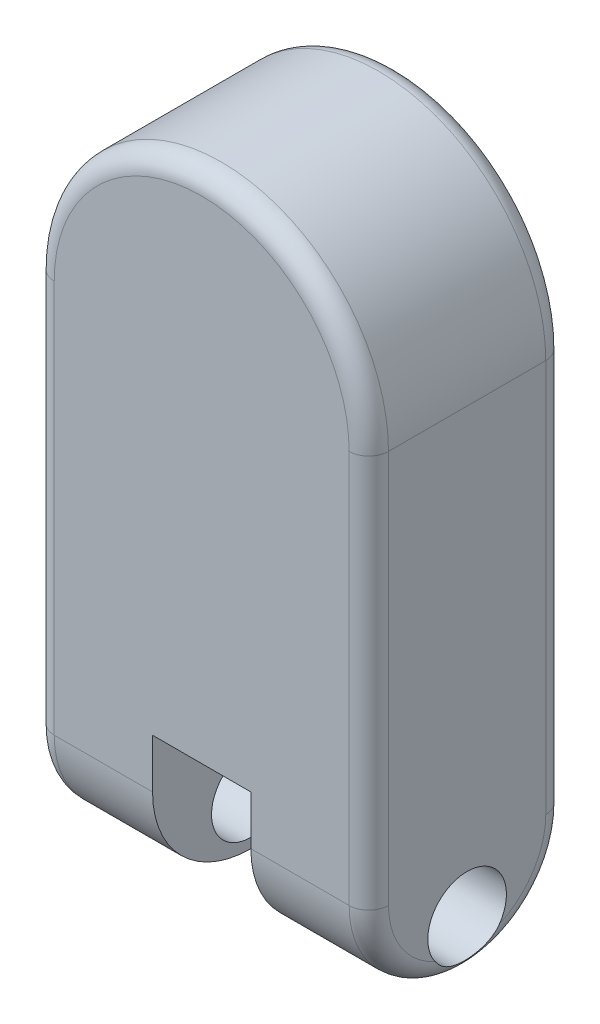
ISO-10303-21;
HEADER;
FILE_DESCRIPTION(('STEP AP214'),'2;1');
FILE_NAME('part.step','',(''),(''),'','','');
FILE_SCHEMA(('AUTOMOTIVE_DESIGN { 1 0 10303 214 1 1 1 1 }'));
ENDSEC;
DATA;
#1=APPLICATION_CONTEXT('core data for automotive mechanical design processes');
#2=APPLICATION_PROTOCOL_DEFINITION('international standard','automotive_design',2000,#1);
#3=PRODUCT_CONTEXT('',#1,'mechanical');
#4=PRODUCT('Part','Part','',(#3));
#5=PRODUCT_RELATED_PRODUCT_CATEGORY('part','',(#4));
#6=PRODUCT_DEFINITION_FORMATION('','',#4);
#7=PRODUCT_DEFINITION_CONTEXT('part definition',#1,'design');
#8=PRODUCT_DEFINITION('design','',#6,#7);
#9=PRODUCT_DEFINITION_SHAPE('','',#8);
#10=(LENGTH_UNIT() NAMED_UNIT(*) SI_UNIT(.MILLI.,.METRE.));
#11=(NAMED_UNIT(*) PLANE_ANGLE_UNIT() SI_UNIT($,.RADIAN.));
#12=(NAMED_UNIT(*) SI_UNIT($,.STERADIAN.) SOLID_ANGLE_UNIT());
#13=UNCERTAINTY_MEASURE_WITH_UNIT(LENGTH_MEASURE(1.E-05),#10,'distance_accuracy_value','');
#14=(GEOMETRIC_REPRESENTATION_CONTEXT(3) GLOBAL_UNCERTAINTY_ASSIGNED_CONTEXT((#13)) GLOBAL_UNIT_ASSIGNED_CONTEXT((#10,
#11,#12)) REPRESENTATION_CONTEXT('',''));
#15=CARTESIAN_POINT('',(0.,0.,0.));
#16=DIRECTION('',(0.,0.,1.));
#17=DIRECTION('',(1.,0.,0.));
#18=AXIS2_PLACEMENT_3D('',#15,#16,#17);
#19=CARTESIAN_POINT('',(-25.,-75.,-100.1));
#20=DIRECTION('',(0.,-1.,0.));
#21=DIRECTION('',(0.,0.,-1.));
#22=AXIS2_PLACEMENT_3D('',#19,#20,#21);
#23=PLANE('',#22);
#24=DIRECTION('',(1.,0.,0.));
#25=VECTOR('',#24,1.);
#26=CARTESIAN_POINT('',(-25.,-75.,-100.));
#27=LINE('',#26,#25);
#28=CARTESIAN_POINT('',(-25.,-75.,-100.));
#29=VERTEX_POINT('',#28);
#30=CARTESIAN_POINT('',(25.,-75.,-100.));
#31=VERTEX_POINT('',#30);
#32=EDGE_CURVE('E92',#29,#31,#27,.T.);
#33=ORIENTED_EDGE('',*,*,#32,.T.);
#34=CARTESIAN_POINT('',(23.5893264020334,-75.,-90.1));
#35=DIRECTION('',(0.,-1.,0.));
#36=DIRECTION('',(0.,0.,-1.));
#37=AXIS2_PLACEMENT_3D('',#34,#35,#36);
#38=CIRCLE('',#37,10.);
#39=CARTESIAN_POINT('',(23.5893264020334,-75.,-100.1));
#40=VERTEX_POINT('',#39);
#41=EDGE_CURVE('E12',#31,#40,#38,.F.);
#42=ORIENTED_EDGE('',*,*,#41,.T.);
#43=DIRECTION('',(1.,0.,0.));
#44=VECTOR('',#43,1.);
#45=CARTESIAN_POINT('',(-25.,-75.,-100.1));
#46=LINE('',#45,#44);
#47=CARTESIAN_POINT('',(-23.5893264020334,-75.,-100.1));
#48=VERTEX_POINT('',#47);
#49=EDGE_CURVE('E116',#48,#40,#46,.T.);
#50=ORIENTED_EDGE('',*,*,#49,.F.);
#51=CARTESIAN_POINT('',(-23.5893264020334,-75.,-90.1));
#52=DIRECTION('',(0.,-1.,0.));
#53=DIRECTION('',(0.,0.,-1.));
#54=AXIS2_PLACEMENT_3D('',#51,#52,#53);
#55=CIRCLE('',#54,10.);
#56=EDGE_CURVE('E55',#48,#29,#55,.F.);
#57=ORIENTED_EDGE('',*,*,#56,.T.);
#58=EDGE_LOOP('',(#33,#42,#50,#57));
#59=FACE_BOUND('',#58,.T.);
#60=ADVANCED_FACE('F46',(#59),#23,.F.);
#61=CARTESIAN_POINT('',(0.,0.,-100.1));
#62=DIRECTION('',(0.,0.,-1.));
#63=DIRECTION('',(-1.,0.,0.));
#64=AXIS2_PLACEMENT_3D('',#61,#62,#63);
#65=PLANE('',#64);
#66=ORIENTED_EDGE('',*,*,#49,.T.);
#67=DIRECTION('',(0.,1.,0.));
#68=VECTOR('',#67,1.);
#69=CARTESIAN_POINT('',(23.5893264020334,-105.,-100.1));
#70=LINE('',#69,#68);
#71=CARTESIAN_POINT('',(23.5893264020334,-103.589326402033,-100.1));
#72=VERTEX_POINT('',#71);
#73=EDGE_CURVE('E104',#40,#72,#70,.F.);
#74=ORIENTED_EDGE('',*,*,#73,.T.);
#75=DIRECTION('',(1.,0.,0.));
#76=VECTOR('',#75,1.);
#77=CARTESIAN_POINT('',(-25.,-103.589326402033,-100.1));
#78=LINE('',#77,#76);
#79=CARTESIAN_POINT('',(-23.5893264020334,-103.589326402033,-100.1));
#80=VERTEX_POINT('',#79);
#81=EDGE_CURVE('E70',#72,#80,#78,.F.);
#82=ORIENTED_EDGE('',*,*,#81,.T.);
#83=DIRECTION('',(0.,-1.,0.));
#84=VECTOR('',#83,1.);
#85=CARTESIAN_POINT('',(-23.5893264020334,-75.,-100.1));
#86=LINE('',#85,#84);
#87=EDGE_CURVE('E107',#80,#48,#86,.F.);
#88=ORIENTED_EDGE('',*,*,#87,.T.);
#89=EDGE_LOOP('',(#66,#74,#82,#88));
#90=FACE_BOUND('',#89,.T.);
#91=ADVANCED_FACE('F120',(#90),#65,.T.);
#92=CARTESIAN_POINT('',(0.,0.,-100.));
#93=DIRECTION('',(0.,0.,-1.));
#94=DIRECTION('',(-1.,0.,0.));
#95=AXIS2_PLACEMENT_3D('',#92,#93,#94);
#96=PLANE('',#95);
#97=ORIENTED_EDGE('',*,*,#32,.F.);
#98=DIRECTION('',(0.,1.,0.));
#99=VECTOR('',#98,1.);
#100=CARTESIAN_POINT('',(-25.,-105.,-100.));
#101=LINE('',#100,#99);
#102=CARTESIAN_POINT('',(-25.,-105.,-100.));
#103=VERTEX_POINT('',#102);
#104=EDGE_CURVE('E115',#103,#29,#101,.T.);
#105=ORIENTED_EDGE('',*,*,#104,.F.);
#106=DIRECTION('',(-1.,0.,0.));
#107=VECTOR('',#106,1.);
#108=CARTESIAN_POINT('',(25.,-105.,-100.));
#109=LINE('',#108,#107);
#110=CARTESIAN_POINT('',(25.,-105.,-100.));
#111=VERTEX_POINT('',#110);
#112=EDGE_CURVE('E95',#111,#103,#109,.T.);
#113=ORIENTED_EDGE('',*,*,#112,.F.);
#114=DIRECTION('',(0.,-1.,0.));
#115=VECTOR('',#114,1.);
#116=CARTESIAN_POINT('',(25.,-75.,-100.));
#117=LINE('',#116,#115);
#118=EDGE_CURVE('E89',#31,#111,#117,.T.);
#119=ORIENTED_EDGE('',*,*,#118,.F.);
#120=EDGE_LOOP('',(#97,#105,#113,#119));
#121=FACE_BOUND('',#120,.T.);
#122=ADVANCED_FACE('F91',(#121),#96,.F.);
#123=CARTESIAN_POINT('',(-23.5893264020334,-105.,-90.1));
#124=DIRECTION('',(0.,1.,0.));
#125=DIRECTION('',(0.,0.,1.));
#126=AXIS2_PLACEMENT_3D('',#123,#124,#125);
#127=CYLINDRICAL_SURFACE('',#126,10.);
#128=ORIENTED_EDGE('',*,*,#56,.F.);
#129=ORIENTED_EDGE('',*,*,#87,.F.);
#130=CARTESIAN_POINT('',(-23.5893264020334,-103.589326402033,-90.1));
#131=DIRECTION('',(-0.707106781186547,0.707106781186547,0.));
#132=DIRECTION('',(0.707106781186547,0.707106781186547,0.));
#133=AXIS2_PLACEMENT_3D('',#130,#131,#132);
#134=ELLIPSE('',#133,14.1421356237309,10.);
#135=EDGE_CURVE('E50',#103,#80,#134,.F.);
#136=ORIENTED_EDGE('',*,*,#135,.F.);
#137=ORIENTED_EDGE('',*,*,#104,.T.);
#138=EDGE_LOOP('',(#128,#129,#136,#137));
#139=FACE_BOUND('',#138,.T.);
#140=ADVANCED_FACE('F48',(#139),#127,.T.);
#141=CARTESIAN_POINT('',(25.,-103.589326402033,-90.1));
#142=DIRECTION('',(-1.,0.,0.));
#143=DIRECTION('',(0.,0.,1.));
#144=AXIS2_PLACEMENT_3D('',#141,#142,#143);
#145=CYLINDRICAL_SURFACE('',#144,10.);
#146=ORIENTED_EDGE('',*,*,#135,.T.);
#147=ORIENTED_EDGE('',*,*,#81,.F.);
#148=CARTESIAN_POINT('',(23.5893264020334,-103.589326402033,-90.1));
#149=DIRECTION('',(-0.707106781186547,-0.707106781186548,0.));
#150=DIRECTION('',(-0.707106781186548,0.707106781186547,0.));
#151=AXIS2_PLACEMENT_3D('',#148,#149,#150);
#152=ELLIPSE('',#151,14.142135623731,10.);
#153=EDGE_CURVE('E63',#111,#72,#152,.F.);
#154=ORIENTED_EDGE('',*,*,#153,.F.);
#155=ORIENTED_EDGE('',*,*,#112,.T.);
#156=EDGE_LOOP('',(#146,#147,#154,#155));
#157=FACE_BOUND('',#156,.T.);
#158=ADVANCED_FACE('F113',(#157),#145,.T.);
#159=CARTESIAN_POINT('',(23.5893264020334,-75.,-90.1));
#160=DIRECTION('',(0.,-1.,0.));
#161=DIRECTION('',(1.,0.,0.));
#162=AXIS2_PLACEMENT_3D('',#159,#160,#161);
#163=CYLINDRICAL_SURFACE('',#162,10.);
#164=ORIENTED_EDGE('',*,*,#41,.F.);
#165=ORIENTED_EDGE('',*,*,#118,.T.);
#166=ORIENTED_EDGE('',*,*,#153,.T.);
#167=ORIENTED_EDGE('',*,*,#73,.F.);
#168=EDGE_LOOP('',(#164,#165,#166,#167));
#169=FACE_BOUND('',#168,.T.);
#170=ADVANCED_FACE('F103',(#169),#163,.T.);
#171=CLOSED_SHELL('',(#60,#91,#122,#140,#158,#170));
#172=MANIFOLD_SOLID_BREP('B2',#171);
#173=CARTESIAN_POINT('',(0.,-75.,-50.));
#174=DIRECTION('',(1.,0.,0.));
#175=DIRECTION('',(0.,0.,-1.));
#176=AXIS2_PLACEMENT_3D('',#173,#174,#175);
#177=CYLINDRICAL_SURFACE('',#176,50.);
#178=DIRECTION('',(1.,0.,0.));
#179=VECTOR('',#178,1.);
#180=CARTESIAN_POINT('',(0.,-75.,0.));
#181=LINE('',#180,#179);
#182=CARTESIAN_POINT('',(-75.,-75.,0.));
#183=VERTEX_POINT('',#182);
#184=CARTESIAN_POINT('',(-25.,-75.,0.));
#185=VERTEX_POINT('',#184);
#186=EDGE_CURVE('E367',#183,#185,#181,.T.);
#187=ORIENTED_EDGE('',*,*,#186,.F.);
#188=CARTESIAN_POINT('',(-75.,-75.,-50.));
#189=DIRECTION('',(-1.,0.,0.));
#190=DIRECTION('',(0.,-1.,0.));
#191=AXIS2_PLACEMENT_3D('',#188,#189,#190);
#192=CIRCLE('',#191,50.);
#193=CARTESIAN_POINT('',(-75.,-125.,-50.));
#194=VERTEX_POINT('',#193);
#195=EDGE_CURVE('E191',#183,#194,#192,.F.);
#196=ORIENTED_EDGE('',*,*,#195,.T.);
#197=DIRECTION('',(1.,0.,0.));
#198=VECTOR('',#197,1.);
#199=CARTESIAN_POINT('',(-85.,-125.,-50.));
#200=LINE('',#199,#198);
#201=CARTESIAN_POINT('',(-25.,-125.,-50.));
#202=VERTEX_POINT('',#201);
#203=EDGE_CURVE('E334',#202,#194,#200,.F.);
#204=ORIENTED_EDGE('',*,*,#203,.F.);
#205=CARTESIAN_POINT('',(-25.,-75.,-50.));
#206=DIRECTION('',(-1.,0.,0.));
#207=DIRECTION('',(0.,0.,1.));
#208=AXIS2_PLACEMENT_3D('',#205,#206,#207);
#209=CIRCLE('',#208,50.);
#210=EDGE_CURVE('E349',#185,#202,#209,.F.);
#211=ORIENTED_EDGE('',*,*,#210,.F.);
#212=EDGE_LOOP('',(#187,#196,#204,#211));
#213=FACE_BOUND('',#212,.T.);
#214=ADVANCED_FACE('F169',(#213),#177,.T.);
#215=CARTESIAN_POINT('',(-85.,-75.,-50.));
#216=DIRECTION('',(-1.,0.,0.));
#217=DIRECTION('',(0.,0.,1.));
#218=AXIS2_PLACEMENT_3D('',#215,#216,#217);
#219=CYLINDRICAL_SURFACE('',#218,50.);
#220=ORIENTED_EDGE('',*,*,#203,.T.);
#221=CARTESIAN_POINT('',(-75.,-75.,-50.));
#222=DIRECTION('',(-1.,0.,0.));
#223=DIRECTION('',(0.,-1.,0.));
#224=AXIS2_PLACEMENT_3D('',#221,#222,#223);
#225=CIRCLE('',#224,50.);
#226=CARTESIAN_POINT('',(-75.,-75.,-100.));
#227=VERTEX_POINT('',#226);
#228=EDGE_CURVE('E177',#194,#227,#225,.F.);
#229=ORIENTED_EDGE('',*,*,#228,.T.);
#230=DIRECTION('',(1.,0.,0.));
#231=VECTOR('',#230,1.);
#232=CARTESIAN_POINT('',(-85.,-75.,-100.));
#233=LINE('',#232,#231);
#234=CARTESIAN_POINT('',(-25.,-75.,-100.));
#235=VERTEX_POINT('',#234);
#236=EDGE_CURVE('E363',#235,#227,#233,.F.);
#237=ORIENTED_EDGE('',*,*,#236,.F.);
#238=CARTESIAN_POINT('',(-25.,-75.,-50.));
#239=DIRECTION('',(-1.,0.,0.));
#240=DIRECTION('',(0.,0.,1.));
#241=AXIS2_PLACEMENT_3D('',#238,#239,#240);
#242=CIRCLE('',#241,50.);
#243=EDGE_CURVE('E355',#202,#235,#242,.F.);
#244=ORIENTED_EDGE('',*,*,#243,.F.);
#245=EDGE_LOOP('',(#220,#229,#237,#244));
#246=FACE_BOUND('',#245,.T.);
#247=ADVANCED_FACE('F466',(#246),#219,.T.);
#248=CARTESIAN_POINT('',(85.,125.,-100.));
#249=DIRECTION('',(1.,0.,0.));
#250=DIRECTION('',(0.,1.,0.));
#251=AXIS2_PLACEMENT_3D('',#248,#249,#250);
#252=PLANE('',#251);
#253=CARTESIAN_POINT('',(85.,-75.,-50.));
#254=DIRECTION('',(1.,0.,0.));
#255=DIRECTION('',(0.,1.,0.));
#256=AXIS2_PLACEMENT_3D('',#253,#254,#255);
#257=CIRCLE('',#256,40.);
#258=CARTESIAN_POINT('',(85.0000000000001,-111.5,-66.3630681719536));
#259=VERTEX_POINT('',#258);
#260=CARTESIAN_POINT('',(85.,-75.,-90.));
#261=VERTEX_POINT('',#260);
#262=EDGE_CURVE('E389',#259,#261,#257,.T.);
#263=ORIENTED_EDGE('',*,*,#262,.T.);
#264=DIRECTION('',(0.,1.,0.));
#265=VECTOR('',#264,1.);
#266=CARTESIAN_POINT('',(85.,125.,-90.));
#267=LINE('',#266,#265);
#268=CARTESIAN_POINT('',(85.,125.,-90.));
#269=VERTEX_POINT('',#268);
#270=EDGE_CURVE('E391',#261,#269,#267,.T.);
#271=ORIENTED_EDGE('',*,*,#270,.T.);
#272=DIRECTION('',(0.,0.,1.));
#273=VECTOR('',#272,1.);
#274=CARTESIAN_POINT('',(85.,125.,-100.));
#275=LINE('',#274,#273);
#276=CARTESIAN_POINT('',(85.,125.,-9.99999999999999));
#277=VERTEX_POINT('',#276);
#278=EDGE_CURVE('E345',#269,#277,#275,.T.);
#279=ORIENTED_EDGE('',*,*,#278,.T.);
#280=DIRECTION('',(0.,1.,0.));
#281=VECTOR('',#280,1.);
#282=CARTESIAN_POINT('',(85.,125.,-9.99999999999999));
#283=LINE('',#282,#281);
#284=CARTESIAN_POINT('',(85.,-75.,-10.));
#285=VERTEX_POINT('',#284);
#286=EDGE_CURVE('E385',#277,#285,#283,.F.);
#287=ORIENTED_EDGE('',*,*,#286,.T.);
#288=CARTESIAN_POINT('',(85.,-75.,-50.));
#289=DIRECTION('',(1.,0.,0.));
#290=DIRECTION('',(0.,1.,0.));
#291=AXIS2_PLACEMENT_3D('',#288,#289,#290);
#292=CIRCLE('',#291,40.);
#293=CARTESIAN_POINT('',(85.,-111.5,-33.6369318280464));
#294=VERTEX_POINT('',#293);
#295=EDGE_CURVE('E387',#285,#294,#292,.T.);
#296=ORIENTED_EDGE('',*,*,#295,.T.);
#297=CARTESIAN_POINT('',(85.,-100.,-50.));
#298=DIRECTION('',(-1.,0.,0.));
#299=DIRECTION('',(0.,-1.,0.));
#300=AXIS2_PLACEMENT_3D('',#297,#298,#299);
#301=CIRCLE('',#300,20.);
#302=EDGE_CURVE('E335',#294,#259,#301,.T.);
#303=ORIENTED_EDGE('',*,*,#302,.T.);
#304=EDGE_LOOP('',(#263,#271,#279,#287,#296,#303));
#305=FACE_BOUND('',#304,.T.);
#306=ADVANCED_FACE('F471',(#305),#252,.T.);
#307=CARTESIAN_POINT('',(-85.,125.,-100.));
#308=DIRECTION('',(-1.,0.,0.));
#309=DIRECTION('',(0.,-1.,0.));
#310=AXIS2_PLACEMENT_3D('',#307,#308,#309);
#311=PLANE('',#310);
#312=CARTESIAN_POINT('',(-85.,-75.,-50.));
#313=DIRECTION('',(-1.,0.,0.));
#314=DIRECTION('',(0.,-1.,0.));
#315=AXIS2_PLACEMENT_3D('',#312,#313,#314);
#316=CIRCLE('',#315,40.);
#317=CARTESIAN_POINT('',(-85.,-111.5,-33.6369318280464));
#318=VERTEX_POINT('',#317);
#319=CARTESIAN_POINT('',(-85.,-75.,-10.));
#320=VERTEX_POINT('',#319);
#321=EDGE_CURVE('E539',#318,#320,#316,.T.);
#322=ORIENTED_EDGE('',*,*,#321,.T.);
#323=DIRECTION('',(0.,-1.,0.));
#324=VECTOR('',#323,1.);
#325=CARTESIAN_POINT('',(-85.,125.,-9.99999999999999));
#326=LINE('',#325,#324);
#327=CARTESIAN_POINT('',(-85.,125.,-9.99999999999999));
#328=VERTEX_POINT('',#327);
#329=EDGE_CURVE('E437',#320,#328,#326,.F.);
#330=ORIENTED_EDGE('',*,*,#329,.T.);
#331=DIRECTION('',(0.,0.,1.));
#332=VECTOR('',#331,1.);
#333=CARTESIAN_POINT('',(-85.,125.,-100.));
#334=LINE('',#333,#332);
#335=CARTESIAN_POINT('',(-85.,125.,-90.));
#336=VERTEX_POINT('',#335);
#337=EDGE_CURVE('E346',#336,#328,#334,.T.);
#338=ORIENTED_EDGE('',*,*,#337,.F.);
#339=DIRECTION('',(0.,-1.,0.));
#340=VECTOR('',#339,1.);
#341=CARTESIAN_POINT('',(-85.,-75.,-90.));
#342=LINE('',#341,#340);
#343=CARTESIAN_POINT('',(-85.,-75.,-90.));
#344=VERTEX_POINT('',#343);
#345=EDGE_CURVE('E533',#336,#344,#342,.T.);
#346=ORIENTED_EDGE('',*,*,#345,.T.);
#347=CARTESIAN_POINT('',(-85.,-75.,-50.));
#348=DIRECTION('',(-1.,0.,0.));
#349=DIRECTION('',(0.,-1.,0.));
#350=AXIS2_PLACEMENT_3D('',#347,#348,#349);
#351=CIRCLE('',#350,40.);
#352=CARTESIAN_POINT('',(-85.,-111.5,-66.3630681719536));
#353=VERTEX_POINT('',#352);
#354=EDGE_CURVE('E538',#344,#353,#351,.T.);
#355=ORIENTED_EDGE('',*,*,#354,.T.);
#356=CARTESIAN_POINT('',(-85.,-100.,-50.));
#357=DIRECTION('',(-1.,0.,0.));
#358=DIRECTION('',(0.,-1.,0.));
#359=AXIS2_PLACEMENT_3D('',#356,#357,#358);
#360=CIRCLE('',#359,20.);
#361=EDGE_CURVE('E339',#318,#353,#360,.T.);
#362=ORIENTED_EDGE('',*,*,#361,.F.);
#363=EDGE_LOOP('',(#322,#330,#338,#346,#355,#362));
#364=FACE_BOUND('',#363,.T.);
#365=ADVANCED_FACE('F544',(#364),#311,.T.);
#366=CARTESIAN_POINT('',(0.,0.,-100.));
#367=DIRECTION('',(0.,0.,1.));
#368=DIRECTION('',(1.,0.,0.));
#369=AXIS2_PLACEMENT_3D('',#366,#367,#368);
#370=PLANE('',#369);
#371=CARTESIAN_POINT('',(0.,125.,-100.));
#372=DIRECTION('',(0.,0.,1.));
#373=DIRECTION('',(1.,0.,0.));
#374=AXIS2_PLACEMENT_3D('',#371,#372,#373);
#375=CIRCLE('',#374,75.);
#376=CARTESIAN_POINT('',(-75.,125.,-100.));
#377=VERTEX_POINT('',#376);
#378=CARTESIAN_POINT('',(75.,125.,-100.));
#379=VERTEX_POINT('',#378);
#380=EDGE_CURVE('E380',#377,#379,#375,.F.);
#381=ORIENTED_EDGE('',*,*,#380,.T.);
#382=DIRECTION('',(0.,1.,0.));
#383=VECTOR('',#382,1.);
#384=CARTESIAN_POINT('',(75.,-75.,-100.));
#385=LINE('',#384,#383);
#386=CARTESIAN_POINT('',(75.,-75.,-100.));
#387=VERTEX_POINT('',#386);
#388=EDGE_CURVE('E383',#379,#387,#385,.F.);
#389=ORIENTED_EDGE('',*,*,#388,.T.);
#390=CARTESIAN_POINT('',(25.,-75.,-100.));
#391=VERTEX_POINT('',#390);
#392=EDGE_CURVE('E368',#387,#391,#233,.F.);
#393=ORIENTED_EDGE('',*,*,#392,.T.);
#394=DIRECTION('',(-1.,0.,0.));
#395=VECTOR('',#394,1.);
#396=CARTESIAN_POINT('',(-25.,-75.,-100.));
#397=LINE('',#396,#395);
#398=EDGE_CURVE('E328',#391,#235,#397,.T.);
#399=ORIENTED_EDGE('',*,*,#398,.T.);
#400=ORIENTED_EDGE('',*,*,#236,.T.);
#401=DIRECTION('',(0.,-1.,0.));
#402=VECTOR('',#401,1.);
#403=CARTESIAN_POINT('',(-75.,125.,-100.));
#404=LINE('',#403,#402);
#405=EDGE_CURVE('E378',#227,#377,#404,.F.);
#406=ORIENTED_EDGE('',*,*,#405,.T.);
#407=EDGE_LOOP('',(#381,#389,#393,#399,#400,#406));
#408=FACE_BOUND('',#407,.T.);
#409=ADVANCED_FACE('F583',(#408),#370,.F.);
#410=CARTESIAN_POINT('',(0.,0.,0.));
#411=DIRECTION('',(0.,0.,1.));
#412=DIRECTION('',(1.,0.,0.));
#413=AXIS2_PLACEMENT_3D('',#410,#411,#412);
#414=PLANE('',#413);
#415=DIRECTION('',(0.,-1.,0.));
#416=VECTOR('',#415,1.);
#417=CARTESIAN_POINT('',(-25.,-75.,0.));
#418=LINE('',#417,#416);
#419=CARTESIAN_POINT('',(-25.,-50.,0.));
#420=VERTEX_POINT('',#419);
#421=EDGE_CURVE('E313',#420,#185,#418,.T.);
#422=ORIENTED_EDGE('',*,*,#421,.F.);
#423=DIRECTION('',(-1.,0.,0.));
#424=VECTOR('',#423,1.);
#425=CARTESIAN_POINT('',(-25.,-50.,0.));
#426=LINE('',#425,#424);
#427=CARTESIAN_POINT('',(25.,-50.,0.));
#428=VERTEX_POINT('',#427);
#429=EDGE_CURVE('E320',#428,#420,#426,.T.);
#430=ORIENTED_EDGE('',*,*,#429,.F.);
#431=DIRECTION('',(0.,1.,0.));
#432=VECTOR('',#431,1.);
#433=CARTESIAN_POINT('',(25.,-50.,0.));
#434=LINE('',#433,#432);
#435=CARTESIAN_POINT('',(25.,-75.,0.));
#436=VERTEX_POINT('',#435);
#437=EDGE_CURVE('E304',#436,#428,#434,.T.);
#438=ORIENTED_EDGE('',*,*,#437,.F.);
#439=CARTESIAN_POINT('',(75.,-75.,0.));
#440=VERTEX_POINT('',#439);
#441=EDGE_CURVE('E370',#436,#440,#181,.T.);
#442=ORIENTED_EDGE('',*,*,#441,.T.);
#443=DIRECTION('',(0.,1.,0.));
#444=VECTOR('',#443,1.);
#445=CARTESIAN_POINT('',(75.,0.,0.));
#446=LINE('',#445,#444);
#447=CARTESIAN_POINT('',(75.,125.,0.));
#448=VERTEX_POINT('',#447);
#449=EDGE_CURVE('E524',#440,#448,#446,.T.);
#450=ORIENTED_EDGE('',*,*,#449,.T.);
#451=CARTESIAN_POINT('',(0.,125.,0.));
#452=DIRECTION('',(0.,0.,1.));
#453=DIRECTION('',(1.,0.,0.));
#454=AXIS2_PLACEMENT_3D('',#451,#452,#453);
#455=CIRCLE('',#454,75.);
#456=CARTESIAN_POINT('',(-75.,125.,0.));
#457=VERTEX_POINT('',#456);
#458=EDGE_CURVE('E529',#448,#457,#455,.T.);
#459=ORIENTED_EDGE('',*,*,#458,.T.);
#460=DIRECTION('',(0.,-1.,0.));
#461=VECTOR('',#460,1.);
#462=CARTESIAN_POINT('',(-75.,0.,0.));
#463=LINE('',#462,#461);
#464=EDGE_CURVE('E498',#457,#183,#463,.T.);
#465=ORIENTED_EDGE('',*,*,#464,.T.);
#466=ORIENTED_EDGE('',*,*,#186,.T.);
#467=EDGE_LOOP('',(#422,#430,#438,#442,#450,#459,#465,#466));
#468=FACE_BOUND('',#467,.T.);
#469=ADVANCED_FACE('F593',(#468),#414,.T.);
#470=CARTESIAN_POINT('',(25.,-150.,-100.));
#471=DIRECTION('',(1.,0.,0.));
#472=DIRECTION('',(0.,0.,-1.));
#473=AXIS2_PLACEMENT_3D('',#470,#471,#472);
#474=PLANE('',#473);
#475=CARTESIAN_POINT('',(25.,-75.,-50.));
#476=DIRECTION('',(1.,0.,0.));
#477=DIRECTION('',(0.,0.,-1.));
#478=AXIS2_PLACEMENT_3D('',#475,#476,#477);
#479=CIRCLE('',#478,50.);
#480=CARTESIAN_POINT('',(25.,-125.,-50.));
#481=VERTEX_POINT('',#480);
#482=EDGE_CURVE('E358',#481,#436,#479,.F.);
#483=ORIENTED_EDGE('',*,*,#482,.T.);
#484=ORIENTED_EDGE('',*,*,#437,.T.);
#485=DIRECTION('',(0.,0.,1.));
#486=VECTOR('',#485,1.);
#487=CARTESIAN_POINT('',(25.,-50.,-99.));
#488=LINE('',#487,#486);
#489=CARTESIAN_POINT('',(25.,-50.,-99.));
#490=VERTEX_POINT('',#489);
#491=EDGE_CURVE('E296',#490,#428,#488,.T.);
#492=ORIENTED_EDGE('',*,*,#491,.F.);
#493=DIRECTION('',(0.,1.,0.));
#494=VECTOR('',#493,1.);
#495=CARTESIAN_POINT('',(25.,-50.,-99.));
#496=LINE('',#495,#494);
#497=CARTESIAN_POINT('',(25.,-74.4302970896538,-99.));
#498=VERTEX_POINT('',#497);
#499=EDGE_CURVE('E302',#498,#490,#496,.T.);
#500=ORIENTED_EDGE('',*,*,#499,.F.);
#501=CARTESIAN_POINT('',(25.,-161.602540378444,-50.));
#502=DIRECTION('',(1.,0.,0.));
#503=DIRECTION('',(0.,0.,-1.));
#504=AXIS2_PLACEMENT_3D('',#501,#502,#503);
#505=CIRCLE('',#504,100.);
#506=EDGE_CURVE('E329',#391,#498,#505,.T.);
#507=ORIENTED_EDGE('',*,*,#506,.F.);
#508=CARTESIAN_POINT('',(25.,-75.,-50.));
#509=DIRECTION('',(1.,0.,0.));
#510=DIRECTION('',(0.,0.,-1.));
#511=AXIS2_PLACEMENT_3D('',#508,#509,#510);
#512=CIRCLE('',#511,50.);
#513=EDGE_CURVE('E360',#391,#481,#512,.F.);
#514=ORIENTED_EDGE('',*,*,#513,.T.);
#515=EDGE_LOOP('',(#483,#484,#492,#500,#507,#514));
#516=FACE_BOUND('',#515,.T.);
#517=CARTESIAN_POINT('',(25.,-100.,-50.));
#518=DIRECTION('',(1.,0.,0.));
#519=DIRECTION('',(0.,0.,-1.));
#520=AXIS2_PLACEMENT_3D('',#517,#518,#519);
#521=CIRCLE('',#520,20.);
#522=CARTESIAN_POINT('',(25.,-100.,-70.));
#523=VERTEX_POINT('',#522);
#524=EDGE_CURVE('E342',#523,#523,#521,.T.);
#525=ORIENTED_EDGE('',*,*,#524,.T.);
#526=EDGE_LOOP('',(#525));
#527=FACE_BOUND('',#526,.T.);
#528=ADVANCED_FACE('F299',(#516,#527),#474,.F.);
#529=CARTESIAN_POINT('',(-25.,-150.,-100.));
#530=DIRECTION('',(-1.,0.,0.));
#531=DIRECTION('',(0.,0.,1.));
#532=AXIS2_PLACEMENT_3D('',#529,#530,#531);
#533=PLANE('',#532);
#534=ORIENTED_EDGE('',*,*,#421,.T.);
#535=ORIENTED_EDGE('',*,*,#210,.T.);
#536=ORIENTED_EDGE('',*,*,#243,.T.);
#537=CARTESIAN_POINT('',(-25.,-161.602540378444,-50.));
#538=DIRECTION('',(1.,0.,0.));
#539=DIRECTION('',(0.,0.,-1.));
#540=AXIS2_PLACEMENT_3D('',#537,#538,#539);
#541=CIRCLE('',#540,100.);
#542=CARTESIAN_POINT('',(-25.,-74.4302970896538,-99.));
#543=VERTEX_POINT('',#542);
#544=EDGE_CURVE('E325',#235,#543,#541,.T.);
#545=ORIENTED_EDGE('',*,*,#544,.T.);
#546=DIRECTION('',(0.,-1.,0.));
#547=VECTOR('',#546,1.);
#548=CARTESIAN_POINT('',(-25.,-75.,-99.));
#549=LINE('',#548,#547);
#550=CARTESIAN_POINT('',(-25.,-50.,-99.));
#551=VERTEX_POINT('',#550);
#552=EDGE_CURVE('E184',#551,#543,#549,.T.);
#553=ORIENTED_EDGE('',*,*,#552,.F.);
#554=DIRECTION('',(0.,0.,1.));
#555=VECTOR('',#554,1.);
#556=CARTESIAN_POINT('',(-25.,-50.,-99.));
#557=LINE('',#556,#555);
#558=EDGE_CURVE('E309',#551,#420,#557,.T.);
#559=ORIENTED_EDGE('',*,*,#558,.T.);
#560=EDGE_LOOP('',(#534,#535,#536,#545,#553,#559));
#561=FACE_BOUND('',#560,.T.);
#562=CARTESIAN_POINT('',(-25.,-100.,-50.));
#563=DIRECTION('',(-1.,0.,0.));
#564=DIRECTION('',(0.,0.,1.));
#565=AXIS2_PLACEMENT_3D('',#562,#563,#564);
#566=CIRCLE('',#565,20.);
#567=CARTESIAN_POINT('',(-25.,-100.,-30.));
#568=VERTEX_POINT('',#567);
#569=EDGE_CURVE('E338',#568,#568,#566,.T.);
#570=ORIENTED_EDGE('',*,*,#569,.T.);
#571=EDGE_LOOP('',(#570));
#572=FACE_BOUND('',#571,.T.);
#573=ADVANCED_FACE('F422',(#561,#572),#533,.F.);
#574=CARTESIAN_POINT('',(85.,-100.,-50.));
#575=DIRECTION('',(-1.,0.,0.));
#576=DIRECTION('',(0.,-1.,0.));
#577=AXIS2_PLACEMENT_3D('',#574,#575,#576);
#578=CYLINDRICAL_SURFACE('',#577,20.);
#579=CARTESIAN_POINT('',(-85.,-111.5,-66.3630681719536));
#580=CARTESIAN_POINT('',(-84.9999944988369,-111.717635786294,-66.2101150233157));
#581=CARTESIAN_POINT('',(-84.9972251505422,-111.932182024762,-66.0528421805291));
#582=CARTESIAN_POINT('',(-84.9867556613727,-112.35473388776,-65.7299474304971));
#583=CARTESIAN_POINT('',(-84.9790561221654,-112.562740307143,-65.5643265442968));
#584=CARTESIAN_POINT('',(-84.9494718778201,-113.176161814739,-65.0555886797702));
#585=CARTESIAN_POINT('',(-84.9210996400918,-113.571325329765,-64.7003530754296));
#586=CARTESIAN_POINT('',(-84.8515096756831,-114.330811895632,-63.9609577577295));
#587=CARTESIAN_POINT('',(-84.8103152955771,-114.695189480587,-63.576851568469));
#588=CARTESIAN_POINT('',(-84.7190573029856,-115.391950208584,-62.7815251896323));
#589=CARTESIAN_POINT('',(-84.6689923089183,-115.724328355308,-62.3703007827167));
#590=CARTESIAN_POINT('',(-84.5631593930954,-116.358618976357,-61.5187034560061));
#591=CARTESIAN_POINT('',(-84.5073357106278,-116.660163582177,-61.0780636594513));
#592=CARTESIAN_POINT('',(-84.3940622995594,-117.226993438192,-60.1742441935076));
#593=CARTESIAN_POINT('',(-84.3366125479803,-117.492278175682,-59.7110642055318));
#594=CARTESIAN_POINT('',(-84.223501755816,-117.985054029716,-58.7648363026767));
#595=CARTESIAN_POINT('',(-84.167840615512,-118.212547256171,-58.2817894988468));
#596=CARTESIAN_POINT('',(-84.0614849028067,-118.628363325728,-57.2985605452277));
#597=CARTESIAN_POINT('',(-84.0107905215469,-118.816684661646,-56.7983777369727));
#598=CARTESIAN_POINT('',(-83.914628020795,-119.162335252227,-55.7553050669512));
#599=CARTESIAN_POINT('',(-83.8696146444547,-119.31732359583,-55.2115959974652));
#600=CARTESIAN_POINT('',(-83.7912772213223,-119.580856141992,-54.1121164115952));
#601=CARTESIAN_POINT('',(-83.7579530630838,-119.689400787352,-53.5563460102591));
#602=CARTESIAN_POINT('',(-83.7183397843355,-119.816752364834,-52.7160701639446));
#603=CARTESIAN_POINT('',(-83.7068534918599,-119.853323941299,-52.434388327726));
#604=CARTESIAN_POINT('',(-83.6875556329067,-119.914450380322,-51.869577925022));
#605=CARTESIAN_POINT('',(-83.6797440577708,-119.939005271195,-51.586449361947));
#606=CARTESIAN_POINT('',(-83.6679366207012,-119.976034163262,-51.0192418997108));
#607=CARTESIAN_POINT('',(-83.6639419207102,-119.988504485659,-50.7351627375596));
#608=CARTESIAN_POINT('',(-83.6598264732936,-120.001327339773,-50.1666967726028));
#609=CARTESIAN_POINT('',(-83.6597058137055,-120.001679596733,-49.882309962968));
#610=CARTESIAN_POINT('',(-83.6615493262836,-119.995960582491,-49.5980542531014));
#611=B_SPLINE_CURVE_WITH_KNOTS('',3,(#579,#580,#581,#582,#583,#584,#585,#586,#587,#588,#589,
#590,#591,#592,#593,#594,#595,#596,#597,#598,#599,#600,#601,#602,#603,#604,#605,#606,#607,#608,
#609,#610),.UNSPECIFIED.,.F.,.F.,(4,2,2,2,2,2,2,2,2,2,2,2,2,2,2,4),(0.,0.797874642750538,
1.59565193352406,3.18994126089919,4.78134451960053,6.37299585463969,7.9818400114366,
9.59070691451069,11.1994839638914,12.8083229014095,14.5077128583875,16.2070866127463,
17.0596892460926,17.91228987052,18.7651499631725,19.6180293930039),.UNSPECIFIED.);
#612=CARTESIAN_POINT('',(-83.6602540378444,-120.,-50.));
#613=VERTEX_POINT('',#612);
#614=EDGE_CURVE('E429',#353,#613,#611,.T.);
#615=ORIENTED_EDGE('',*,*,#614,.T.);
#616=CARTESIAN_POINT('',(-83.6602540378444,-120.,-50.));
#617=CARTESIAN_POINT('',(-83.660247528865,-120.000000557423,-49.7291162562174));
#618=CARTESIAN_POINT('',(-83.6620203059655,-119.994495715576,-49.4582663052626));
#619=CARTESIAN_POINT('',(-83.6690632302412,-119.972496289671,-48.9170644816353));
#620=CARTESIAN_POINT('',(-83.6743333002116,-119.956001948214,-48.6467125980998));
#621=CARTESIAN_POINT('',(-83.6952902819852,-119.8900894424,-47.8373209986367));
#622=CARTESIAN_POINT('',(-83.7161240917141,-119.824241746037,-47.2996541799824));
#623=CARTESIAN_POINT('',(-83.7701739357349,-119.649543192614,-46.2334838396406));
#624=CARTESIAN_POINT('',(-83.8033583037589,-119.540802269524,-45.7049604702912));
#625=CARTESIAN_POINT('',(-83.8801161670473,-119.281208901752,-44.6590938773701));
#626=CARTESIAN_POINT('',(-83.9236903013259,-119.130353866779,-44.1417513436021));
#627=CARTESIAN_POINT('',(-84.0189152913429,-118.786789461718,-43.1189296044383));
#628=CARTESIAN_POINT('',(-84.0706068716683,-118.593867036125,-42.6135258599768));
#629=CARTESIAN_POINT('',(-84.1788835403941,-118.16796707267,-41.6204488654864));
#630=CARTESIAN_POINT('',(-84.2354685830894,-117.934989908899,-41.1327754499163));
#631=CARTESIAN_POINT('',(-84.3502215235499,-117.430402873405,-40.1779497284365));
#632=CARTESIAN_POINT('',(-84.4083896442132,-117.158787538414,-39.7108003367798));
#633=CARTESIAN_POINT('',(-84.5227473765823,-116.578517537487,-38.7998012021265));
#634=CARTESIAN_POINT('',(-84.5789368427548,-116.269860154377,-38.3559531718098));
#635=CARTESIAN_POINT('',(-84.6878982994192,-115.602912464245,-37.4753289636808));
#636=CARTESIAN_POINT('',(-84.740412180585,-115.243038677624,-37.0397174887075));
#637=CARTESIAN_POINT('',(-84.8345685865418,-114.487138492257,-36.1999281519389));
#638=CARTESIAN_POINT('',(-84.8762127470129,-114.09111754507,-35.7957455671454));
#639=CARTESIAN_POINT('',(-84.9437724111679,-113.26432007541,-35.0206968408248));
#640=CARTESIAN_POINT('',(-84.969646571122,-112.833455521703,-34.6499204268788));
#641=CARTESIAN_POINT('',(-84.992406932906,-112.164262783443,-34.1219764911395));
#642=CARTESIAN_POINT('',(-84.997317042392,-111.937265917523,-33.9506217314705));
#643=CARTESIAN_POINT('',(-85.001019493978,-111.47611190923,-33.6177002554482));
#644=CARTESIAN_POINT('',(-84.9998109947272,-111.241953786537,-33.4561348882949));
#645=CARTESIAN_POINT('',(-84.9951651075579,-111.004453188326,-33.299640422256));
#646=B_SPLINE_CURVE_WITH_KNOTS('',3,(#616,#617,#618,#619,#620,#621,#622,#623,#624,#625,#626,
#627,#628,#629,#630,#631,#632,#633,#634,#635,#636,#637,#638,#639,#640,#641,#642,#643,#644,#645),
.UNSPECIFIED.,.F.,.F.,(4,2,2,2,2,2,2,2,2,2,2,2,2,2,4),(0.,0.81252243782489,1.62502693931455,
3.24916534614429,4.86916790626039,6.48927012904759,8.1177764581638,9.74626757863837,
11.3749891898565,13.0038303470725,14.704137296452,16.404188235224,18.1086771866605,
18.9617565600298,19.8149532408674),.UNSPECIFIED.);
#647=EDGE_CURVE('E436',#613,#318,#646,.T.);
#648=ORIENTED_EDGE('',*,*,#647,.T.);
#649=ORIENTED_EDGE('',*,*,#361,.T.);
#650=EDGE_LOOP('',(#615,#648,#649));
#651=FACE_BOUND('',#650,.T.);
#652=ORIENTED_EDGE('',*,*,#569,.F.);
#653=EDGE_LOOP('',(#652));
#654=FACE_BOUND('',#653,.T.);
#655=ADVANCED_FACE('F418',(#651,#654),#578,.F.);
#656=CARTESIAN_POINT('',(85.,-111.5,-33.6369318280464));
#657=CARTESIAN_POINT('',(84.9999944988369,-111.717635786294,-33.7898849766843));
#658=CARTESIAN_POINT('',(84.9972251505423,-111.932182024762,-33.9471578194709));
#659=CARTESIAN_POINT('',(84.9867556613727,-112.35473388776,-34.270052569503));
#660=CARTESIAN_POINT('',(84.9790561221654,-112.562740307143,-34.4356734557032));
#661=CARTESIAN_POINT('',(84.9494718778202,-113.176161814739,-34.9444113202299));
#662=CARTESIAN_POINT('',(84.9210996400919,-113.571325329765,-35.2996469245705));
#663=CARTESIAN_POINT('',(84.8515096756831,-114.330811895632,-36.0390422422705));
#664=CARTESIAN_POINT('',(84.8103152955772,-114.695189480587,-36.4231484315311));
#665=CARTESIAN_POINT('',(84.7190573029856,-115.391950208584,-37.2184748103677));
#666=CARTESIAN_POINT('',(84.6689923089184,-115.724328355308,-37.6296992172834));
#667=CARTESIAN_POINT('',(84.5631593930955,-116.358618976357,-38.481296543994));
#668=CARTESIAN_POINT('',(84.5073357106278,-116.660163582177,-38.9219363405488));
#669=CARTESIAN_POINT('',(84.3940622995595,-117.226993438192,-39.8257558064925));
#670=CARTESIAN_POINT('',(84.3366125479804,-117.492278175682,-40.2889357944682));
#671=CARTESIAN_POINT('',(84.223501755816,-117.985054029716,-41.2351636973234));
#672=CARTESIAN_POINT('',(84.1678406155121,-118.212547256171,-41.7182105011533));
#673=CARTESIAN_POINT('',(84.0614849028068,-118.628363325728,-42.7014394547724));
#674=CARTESIAN_POINT('',(84.010790521547,-118.816684661646,-43.2016222630274));
#675=CARTESIAN_POINT('',(83.914628020795,-119.162335252227,-44.2446949330489));
#676=CARTESIAN_POINT('',(83.8696146444547,-119.31732359583,-44.7884040025349));
#677=CARTESIAN_POINT('',(83.7912772213223,-119.580856141992,-45.8878835884048));
#678=CARTESIAN_POINT('',(83.7579530630839,-119.689400787352,-46.443653989741));
#679=CARTESIAN_POINT('',(83.7183397843356,-119.816752364834,-47.2839298360555));
#680=CARTESIAN_POINT('',(83.7068534918599,-119.853323941299,-47.5656116722741));
#681=CARTESIAN_POINT('',(83.6875556329068,-119.914450380322,-48.1304220749781));
#682=CARTESIAN_POINT('',(83.6797440577709,-119.939005271195,-48.4135506380531));
#683=CARTESIAN_POINT('',(83.6679366207012,-119.976034163262,-48.9807581002893));
#684=CARTESIAN_POINT('',(83.6639419207103,-119.988504485659,-49.2648372624404));
#685=CARTESIAN_POINT('',(83.6598264732937,-120.001327339773,-49.8333032273972));
#686=CARTESIAN_POINT('',(83.6597058137055,-120.001679596733,-50.1176900370321));
#687=CARTESIAN_POINT('',(83.6615493262836,-119.995960582491,-50.4019457468987));
#688=B_SPLINE_CURVE_WITH_KNOTS('',3,(#656,#657,#658,#659,#660,#661,#662,#663,#664,#665,#666,
#667,#668,#669,#670,#671,#672,#673,#674,#675,#676,#677,#678,#679,#680,#681,#682,#683,#684,#685,
#686,#687),.UNSPECIFIED.,.F.,.F.,(4,2,2,2,2,2,2,2,2,2,2,2,2,2,2,4),(0.,0.797874642750553,
1.59565193352408,3.18994126089918,4.7813445196005,6.3729958546397,7.98184001143661,
9.59070691451071,11.1994839638915,12.8083229014096,14.5077128583875,16.2070866127463,
17.0596892460926,17.91228987052,18.7651499631725,19.6180293930039),.UNSPECIFIED.);
#689=CARTESIAN_POINT('',(83.6602540378444,-120.,-50.));
#690=VERTEX_POINT('',#689);
#691=EDGE_CURVE('E393',#294,#690,#688,.T.);
#692=ORIENTED_EDGE('',*,*,#691,.T.);
#693=CARTESIAN_POINT('',(83.6602540378444,-120.,-50.));
#694=CARTESIAN_POINT('',(83.660247528865,-120.000000557423,-50.2708837437826));
#695=CARTESIAN_POINT('',(83.6620203059656,-119.994495715576,-50.5417336947374));
#696=CARTESIAN_POINT('',(83.6690632302413,-119.972496289671,-51.0829355183647));
#697=CARTESIAN_POINT('',(83.6743333002116,-119.956001948214,-51.3532874019002));
#698=CARTESIAN_POINT('',(83.6952902819852,-119.8900894424,-52.1626790013634));
#699=CARTESIAN_POINT('',(83.7161240917141,-119.824241746037,-52.7003458200177));
#700=CARTESIAN_POINT('',(83.7701739357349,-119.649543192614,-53.7665161603594));
#701=CARTESIAN_POINT('',(83.8033583037589,-119.540802269524,-54.2950395297088));
#702=CARTESIAN_POINT('',(83.8801161670473,-119.281208901752,-55.3409061226299));
#703=CARTESIAN_POINT('',(83.9236903013259,-119.130353866779,-55.8582486563979));
#704=CARTESIAN_POINT('',(84.0189152913429,-118.786789461718,-56.8810703955617));
#705=CARTESIAN_POINT('',(84.0706068716683,-118.593867036125,-57.3864741400232));
#706=CARTESIAN_POINT('',(84.1788835403941,-118.16796707267,-58.3795511345136));
#707=CARTESIAN_POINT('',(84.2354685830894,-117.934989908899,-58.8672245500837));
#708=CARTESIAN_POINT('',(84.35022152355,-117.430402873405,-59.8220502715635));
#709=CARTESIAN_POINT('',(84.4083896442133,-117.158787538414,-60.2891996632202));
#710=CARTESIAN_POINT('',(84.5227473765824,-116.578517537487,-61.2001987978735));
#711=CARTESIAN_POINT('',(84.5789368427548,-116.269860154377,-61.6440468281903));
#712=CARTESIAN_POINT('',(84.6878982994192,-115.602912464245,-62.5246710363192));
#713=CARTESIAN_POINT('',(84.740412180585,-115.243038677624,-62.9602825112926));
#714=CARTESIAN_POINT('',(84.8345685865418,-114.487138492257,-63.8000718480611));
#715=CARTESIAN_POINT('',(84.8762127470129,-114.09111754507,-64.2042544328546));
#716=CARTESIAN_POINT('',(84.943772411168,-113.26432007541,-64.9793031591752));
#717=CARTESIAN_POINT('',(84.969646571122,-112.833455521703,-65.3500795731212));
#718=CARTESIAN_POINT('',(84.992406932906,-112.164262783443,-65.8780235088606));
#719=CARTESIAN_POINT('',(84.9973170423921,-111.937265917523,-66.0493782685295));
#720=CARTESIAN_POINT('',(85.001019493978,-111.47611190923,-66.3822997445518));
#721=CARTESIAN_POINT('',(84.9998109947272,-111.241953786537,-66.5438651117052));
#722=CARTESIAN_POINT('',(84.9951651075579,-111.004453188326,-66.700359577744));
#723=B_SPLINE_CURVE_WITH_KNOTS('',3,(#693,#694,#695,#696,#697,#698,#699,#700,#701,#702,#703,
#704,#705,#706,#707,#708,#709,#710,#711,#712,#713,#714,#715,#716,#717,#718,#719,#720,#721,#722),
.UNSPECIFIED.,.F.,.F.,(4,2,2,2,2,2,2,2,2,2,2,2,2,2,4),(0.,0.81252243782489,1.62502693931456,
3.24916534614429,4.86916790626037,6.48927012904759,8.11777645816379,9.74626757863837,
11.3749891898565,13.0038303470725,14.7041372964521,16.404188235224,18.1086771866605,
18.9617565600298,19.8149532408674),.UNSPECIFIED.);
#724=EDGE_CURVE('E401',#690,#259,#723,.T.);
#725=ORIENTED_EDGE('',*,*,#724,.T.);
#726=ORIENTED_EDGE('',*,*,#302,.F.);
#727=EDGE_LOOP('',(#692,#725,#726));
#728=FACE_BOUND('',#727,.T.);
#729=ORIENTED_EDGE('',*,*,#524,.F.);
#730=EDGE_LOOP('',(#729));
#731=FACE_BOUND('',#730,.T.);
#732=ADVANCED_FACE('F412',(#728,#731),#578,.F.);
#733=DIRECTION('',(1.,0.,0.));
#734=VECTOR('',#733,1.);
#735=CARTESIAN_POINT('',(55.,-125.,-50.));
#736=LINE('',#735,#734);
#737=CARTESIAN_POINT('',(75.,-125.,-50.));
#738=VERTEX_POINT('',#737);
#739=EDGE_CURVE('E364',#738,#481,#736,.F.);
#740=ORIENTED_EDGE('',*,*,#739,.F.);
#741=CARTESIAN_POINT('',(75.,-75.,-50.));
#742=DIRECTION('',(1.,0.,0.));
#743=DIRECTION('',(0.,1.,0.));
#744=AXIS2_PLACEMENT_3D('',#741,#742,#743);
#745=CIRCLE('',#744,50.);
#746=EDGE_CURVE('E486',#738,#440,#745,.F.);
#747=ORIENTED_EDGE('',*,*,#746,.T.);
#748=ORIENTED_EDGE('',*,*,#441,.F.);
#749=ORIENTED_EDGE('',*,*,#482,.F.);
#750=EDGE_LOOP('',(#740,#747,#748,#749));
#751=FACE_BOUND('',#750,.T.);
#752=ADVANCED_FACE('F417',(#751),#177,.T.);
#753=ORIENTED_EDGE('',*,*,#392,.F.);
#754=CARTESIAN_POINT('',(75.,-75.,-50.));
#755=DIRECTION('',(1.,0.,0.));
#756=DIRECTION('',(0.,1.,0.));
#757=AXIS2_PLACEMENT_3D('',#754,#755,#756);
#758=CIRCLE('',#757,50.);
#759=EDGE_CURVE('E499',#387,#738,#758,.F.);
#760=ORIENTED_EDGE('',*,*,#759,.T.);
#761=ORIENTED_EDGE('',*,*,#739,.T.);
#762=ORIENTED_EDGE('',*,*,#513,.F.);
#763=EDGE_LOOP('',(#753,#760,#761,#762));
#764=FACE_BOUND('',#763,.T.);
#765=ADVANCED_FACE('F474',(#764),#219,.T.);
#766=CARTESIAN_POINT('',(-25.,-161.602540378444,-50.));
#767=DIRECTION('',(1.,0.,0.));
#768=DIRECTION('',(0.,0.,-1.));
#769=AXIS2_PLACEMENT_3D('',#766,#767,#768);
#770=CYLINDRICAL_SURFACE('',#769,100.);
#771=ORIENTED_EDGE('',*,*,#506,.T.);
#772=DIRECTION('',(1.,0.,0.));
#773=VECTOR('',#772,1.);
#774=CARTESIAN_POINT('',(-25.,-74.4302970896538,-99.));
#775=LINE('',#774,#773);
#776=EDGE_CURVE('E44',#498,#543,#775,.F.);
#777=ORIENTED_EDGE('',*,*,#776,.T.);
#778=ORIENTED_EDGE('',*,*,#544,.F.);
#779=ORIENTED_EDGE('',*,*,#398,.F.);
#780=EDGE_LOOP('',(#771,#777,#778,#779));
#781=FACE_BOUND('',#780,.T.);
#782=ADVANCED_FACE('F420',(#781),#770,.F.);
#783=CARTESIAN_POINT('',(0.,125.,-100.));
#784=DIRECTION('',(0.,0.,1.));
#785=DIRECTION('',(1.,0.,0.));
#786=AXIS2_PLACEMENT_3D('',#783,#784,#785);
#787=CYLINDRICAL_SURFACE('',#786,85.);
#788=ORIENTED_EDGE('',*,*,#278,.F.);
#789=CARTESIAN_POINT('',(0.,125.,-90.));
#790=DIRECTION('',(0.,0.,1.));
#791=DIRECTION('',(1.,0.,0.));
#792=AXIS2_PLACEMENT_3D('',#789,#790,#791);
#793=CIRCLE('',#792,85.);
#794=EDGE_CURVE('E375',#269,#336,#793,.T.);
#795=ORIENTED_EDGE('',*,*,#794,.T.);
#796=ORIENTED_EDGE('',*,*,#337,.T.);
#797=CARTESIAN_POINT('',(0.,125.,-9.99999999999999));
#798=DIRECTION('',(0.,0.,1.));
#799=DIRECTION('',(1.,0.,0.));
#800=AXIS2_PLACEMENT_3D('',#797,#798,#799);
#801=CIRCLE('',#800,85.);
#802=EDGE_CURVE('E366',#328,#277,#801,.F.);
#803=ORIENTED_EDGE('',*,*,#802,.T.);
#804=EDGE_LOOP('',(#788,#795,#796,#803));
#805=FACE_BOUND('',#804,.T.);
#806=ADVANCED_FACE('F549',(#805),#787,.T.);
#807=CARTESIAN_POINT('',(0.,125.,-9.99999999999999));
#808=DIRECTION('',(0.,0.,1.));
#809=DIRECTION('',(1.,0.,0.));
#810=AXIS2_PLACEMENT_3D('',#807,#808,#809);
#811=TOROIDAL_SURFACE('',#810,75.,10.);
#812=CARTESIAN_POINT('',(-75.,125.,-10.));
#813=DIRECTION('',(0.,-1.,0.));
#814=DIRECTION('',(0.,0.,-1.));
#815=AXIS2_PLACEMENT_3D('',#812,#813,#814);
#816=CIRCLE('',#815,10.);
#817=EDGE_CURVE('E516',#457,#328,#816,.T.);
#818=ORIENTED_EDGE('',*,*,#817,.F.);
#819=ORIENTED_EDGE('',*,*,#458,.F.);
#820=CARTESIAN_POINT('',(75.,125.,-9.99999999999999));
#821=DIRECTION('',(0.,-1.,0.));
#822=DIRECTION('',(0.,0.,-1.));
#823=AXIS2_PLACEMENT_3D('',#820,#821,#822);
#824=CIRCLE('',#823,10.);
#825=EDGE_CURVE('E331',#277,#448,#824,.T.);
#826=ORIENTED_EDGE('',*,*,#825,.F.);
#827=ORIENTED_EDGE('',*,*,#802,.F.);
#828=EDGE_LOOP('',(#818,#819,#826,#827));
#829=FACE_BOUND('',#828,.T.);
#830=ADVANCED_FACE('F171',(#829),#811,.T.);
#831=CARTESIAN_POINT('',(75.,0.,-10.));
#832=DIRECTION('',(0.,1.,0.));
#833=DIRECTION('',(-1.,0.,0.));
#834=AXIS2_PLACEMENT_3D('',#831,#832,#833);
#835=CYLINDRICAL_SURFACE('',#834,10.);
#836=ORIENTED_EDGE('',*,*,#825,.T.);
#837=ORIENTED_EDGE('',*,*,#449,.F.);
#838=CARTESIAN_POINT('',(75.,-75.,-10.));
#839=DIRECTION('',(0.,-1.,0.));
#840=DIRECTION('',(0.,0.,-1.));
#841=AXIS2_PLACEMENT_3D('',#838,#839,#840);
#842=CIRCLE('',#841,10.);
#843=EDGE_CURVE('E497',#285,#440,#842,.T.);
#844=ORIENTED_EDGE('',*,*,#843,.F.);
#845=ORIENTED_EDGE('',*,*,#286,.F.);
#846=EDGE_LOOP('',(#836,#837,#844,#845));
#847=FACE_BOUND('',#846,.T.);
#848=ADVANCED_FACE('F523',(#847),#835,.T.);
#849=CARTESIAN_POINT('',(-75.,0.,-10.));
#850=DIRECTION('',(0.,-1.,0.));
#851=DIRECTION('',(1.,0.,0.));
#852=AXIS2_PLACEMENT_3D('',#849,#850,#851);
#853=CYLINDRICAL_SURFACE('',#852,10.);
#854=ORIENTED_EDGE('',*,*,#817,.T.);
#855=ORIENTED_EDGE('',*,*,#329,.F.);
#856=CARTESIAN_POINT('',(-75.,-75.,-10.));
#857=DIRECTION('',(0.,-1.,0.));
#858=DIRECTION('',(0.,0.,-1.));
#859=AXIS2_PLACEMENT_3D('',#856,#857,#858);
#860=CIRCLE('',#859,10.);
#861=EDGE_CURVE('E505',#183,#320,#860,.T.);
#862=ORIENTED_EDGE('',*,*,#861,.F.);
#863=ORIENTED_EDGE('',*,*,#464,.F.);
#864=EDGE_LOOP('',(#854,#855,#862,#863));
#865=FACE_BOUND('',#864,.T.);
#866=ADVANCED_FACE('F462',(#865),#853,.T.);
#867=CARTESIAN_POINT('',(75.,-75.,-50.));
#868=DIRECTION('',(1.,0.,0.));
#869=DIRECTION('',(0.,1.,0.));
#870=AXIS2_PLACEMENT_3D('',#867,#868,#869);
#871=TOROIDAL_SURFACE('',#870,40.,10.);
#872=ORIENTED_EDGE('',*,*,#843,.T.);
#873=ORIENTED_EDGE('',*,*,#746,.F.);
#874=CARTESIAN_POINT('',(75.,-115.,-50.));
#875=DIRECTION('',(0.,0.,-1.));
#876=DIRECTION('',(-1.,0.,0.));
#877=AXIS2_PLACEMENT_3D('',#874,#875,#876);
#878=CIRCLE('',#877,10.);
#879=EDGE_CURVE('E493',#690,#738,#878,.T.);
#880=ORIENTED_EDGE('',*,*,#879,.F.);
#881=ORIENTED_EDGE('',*,*,#691,.F.);
#882=ORIENTED_EDGE('',*,*,#295,.F.);
#883=EDGE_LOOP('',(#872,#873,#880,#881,#882));
#884=FACE_BOUND('',#883,.T.);
#885=ADVANCED_FACE('F408',(#884),#871,.T.);
#886=CARTESIAN_POINT('',(-75.,-75.,-50.));
#887=DIRECTION('',(-1.,0.,0.));
#888=DIRECTION('',(0.,-1.,0.));
#889=AXIS2_PLACEMENT_3D('',#886,#887,#888);
#890=TOROIDAL_SURFACE('',#889,40.,10.);
#891=ORIENTED_EDGE('',*,*,#321,.F.);
#892=ORIENTED_EDGE('',*,*,#647,.F.);
#893=CARTESIAN_POINT('',(-75.,-115.,-50.));
#894=DIRECTION('',(0.,0.,-1.));
#895=DIRECTION('',(-1.,0.,0.));
#896=AXIS2_PLACEMENT_3D('',#893,#894,#895);
#897=CIRCLE('',#896,10.);
#898=EDGE_CURVE('E506',#194,#613,#897,.T.);
#899=ORIENTED_EDGE('',*,*,#898,.F.);
#900=ORIENTED_EDGE('',*,*,#195,.F.);
#901=ORIENTED_EDGE('',*,*,#861,.T.);
#902=EDGE_LOOP('',(#891,#892,#899,#900,#901));
#903=FACE_BOUND('',#902,.T.);
#904=ADVANCED_FACE('F454',(#903),#890,.T.);
#905=CARTESIAN_POINT('',(75.,-75.,-50.));
#906=DIRECTION('',(1.,0.,0.));
#907=DIRECTION('',(0.,1.,0.));
#908=AXIS2_PLACEMENT_3D('',#905,#906,#907);
#909=TOROIDAL_SURFACE('',#908,40.,10.);
#910=ORIENTED_EDGE('',*,*,#879,.T.);
#911=ORIENTED_EDGE('',*,*,#759,.F.);
#912=CARTESIAN_POINT('',(75.,-75.,-90.));
#913=DIRECTION('',(0.,1.,0.));
#914=DIRECTION('',(0.,0.,1.));
#915=AXIS2_PLACEMENT_3D('',#912,#913,#914);
#916=CIRCLE('',#915,10.);
#917=EDGE_CURVE('E511',#261,#387,#916,.T.);
#918=ORIENTED_EDGE('',*,*,#917,.F.);
#919=ORIENTED_EDGE('',*,*,#262,.F.);
#920=ORIENTED_EDGE('',*,*,#724,.F.);
#921=EDGE_LOOP('',(#910,#911,#918,#919,#920));
#922=FACE_BOUND('',#921,.T.);
#923=ADVANCED_FACE('F449',(#922),#909,.T.);
#924=CARTESIAN_POINT('',(-75.,-75.,-50.));
#925=DIRECTION('',(-1.,0.,0.));
#926=DIRECTION('',(0.,-1.,0.));
#927=AXIS2_PLACEMENT_3D('',#924,#925,#926);
#928=TOROIDAL_SURFACE('',#927,40.,10.);
#929=ORIENTED_EDGE('',*,*,#614,.F.);
#930=ORIENTED_EDGE('',*,*,#354,.F.);
#931=CARTESIAN_POINT('',(-75.,-75.,-90.));
#932=DIRECTION('',(0.,1.,0.));
#933=DIRECTION('',(0.,0.,1.));
#934=AXIS2_PLACEMENT_3D('',#931,#932,#933);
#935=CIRCLE('',#934,10.);
#936=EDGE_CURVE('E565',#227,#344,#935,.T.);
#937=ORIENTED_EDGE('',*,*,#936,.F.);
#938=ORIENTED_EDGE('',*,*,#228,.F.);
#939=ORIENTED_EDGE('',*,*,#898,.T.);
#940=EDGE_LOOP('',(#929,#930,#937,#938,#939));
#941=FACE_BOUND('',#940,.T.);
#942=ADVANCED_FACE('F444',(#941),#928,.T.);
#943=CARTESIAN_POINT('',(75.,125.,-90.));
#944=DIRECTION('',(0.,-1.,0.));
#945=DIRECTION('',(1.,0.,0.));
#946=AXIS2_PLACEMENT_3D('',#943,#944,#945);
#947=CYLINDRICAL_SURFACE('',#946,10.);
#948=ORIENTED_EDGE('',*,*,#917,.T.);
#949=ORIENTED_EDGE('',*,*,#388,.F.);
#950=CARTESIAN_POINT('',(75.,125.,-90.));
#951=DIRECTION('',(0.,1.,0.));
#952=DIRECTION('',(0.,0.,1.));
#953=AXIS2_PLACEMENT_3D('',#950,#951,#952);
#954=CIRCLE('',#953,10.);
#955=EDGE_CURVE('E555',#269,#379,#954,.T.);
#956=ORIENTED_EDGE('',*,*,#955,.F.);
#957=ORIENTED_EDGE('',*,*,#270,.F.);
#958=EDGE_LOOP('',(#948,#949,#956,#957));
#959=FACE_BOUND('',#958,.T.);
#960=ADVANCED_FACE('F448',(#959),#947,.T.);
#961=CARTESIAN_POINT('',(-75.,125.,-90.));
#962=DIRECTION('',(0.,1.,0.));
#963=DIRECTION('',(-1.,0.,0.));
#964=AXIS2_PLACEMENT_3D('',#961,#962,#963);
#965=CYLINDRICAL_SURFACE('',#964,10.);
#966=ORIENTED_EDGE('',*,*,#936,.T.);
#967=ORIENTED_EDGE('',*,*,#345,.F.);
#968=CARTESIAN_POINT('',(-75.,125.,-90.));
#969=DIRECTION('',(0.,1.,0.));
#970=DIRECTION('',(0.,0.,1.));
#971=AXIS2_PLACEMENT_3D('',#968,#969,#970);
#972=CIRCLE('',#971,10.);
#973=EDGE_CURVE('E323',#377,#336,#972,.T.);
#974=ORIENTED_EDGE('',*,*,#973,.F.);
#975=ORIENTED_EDGE('',*,*,#405,.F.);
#976=EDGE_LOOP('',(#966,#967,#974,#975));
#977=FACE_BOUND('',#976,.T.);
#978=ADVANCED_FACE('F563',(#977),#965,.T.);
#979=CARTESIAN_POINT('',(0.,125.,-90.));
#980=DIRECTION('',(0.,0.,1.));
#981=DIRECTION('',(1.,0.,0.));
#982=AXIS2_PLACEMENT_3D('',#979,#980,#981);
#983=TOROIDAL_SURFACE('',#982,75.,10.);
#984=ORIENTED_EDGE('',*,*,#955,.T.);
#985=ORIENTED_EDGE('',*,*,#380,.F.);
#986=ORIENTED_EDGE('',*,*,#973,.T.);
#987=ORIENTED_EDGE('',*,*,#794,.F.);
#988=EDGE_LOOP('',(#984,#985,#986,#987));
#989=FACE_BOUND('',#988,.T.);
#990=ADVANCED_FACE('F553',(#989),#983,.T.);
#991=CARTESIAN_POINT('',(-25.,-50.,-99.));
#992=DIRECTION('',(0.,1.,0.));
#993=DIRECTION('',(-1.,0.,0.));
#994=AXIS2_PLACEMENT_3D('',#991,#992,#993);
#995=PLANE('',#994);
#996=ORIENTED_EDGE('',*,*,#491,.T.);
#997=ORIENTED_EDGE('',*,*,#429,.T.);
#998=ORIENTED_EDGE('',*,*,#558,.F.);
#999=DIRECTION('',(-1.,0.,0.));
#1000=VECTOR('',#999,1.);
#1001=CARTESIAN_POINT('',(-25.,-50.,-99.));
#1002=LINE('',#1001,#1000);
#1003=EDGE_CURVE('E312',#490,#551,#1002,.T.);
#1004=ORIENTED_EDGE('',*,*,#1003,.F.);
#1005=EDGE_LOOP('',(#996,#997,#998,#1004));
#1006=FACE_BOUND('',#1005,.T.);
#1007=ADVANCED_FACE('F315',(#1006),#995,.F.);
#1008=CARTESIAN_POINT('',(0.,0.,-99.));
#1009=DIRECTION('',(0.,0.,-1.));
#1010=DIRECTION('',(-1.,0.,0.));
#1011=AXIS2_PLACEMENT_3D('',#1008,#1009,#1010);
#1012=PLANE('',#1011);
#1013=ORIENTED_EDGE('',*,*,#499,.T.);
#1014=ORIENTED_EDGE('',*,*,#1003,.T.);
#1015=ORIENTED_EDGE('',*,*,#552,.T.);
#1016=ORIENTED_EDGE('',*,*,#776,.F.);
#1017=EDGE_LOOP('',(#1013,#1014,#1015,#1016));
#1018=FACE_BOUND('',#1017,.T.);
#1019=ADVANCED_FACE('F311',(#1018),#1012,.F.);
#1020=CLOSED_SHELL('',(#214,#247,#306,#365,#409,#469,#528,#573,#655,#732,#752,#765,#782,#806,
#830,#848,#866,#885,#904,#923,#942,#960,#978,#990,#1007,#1019));
#1021=MANIFOLD_SOLID_BREP('B6',#1020);
#1022=ADVANCED_BREP_SHAPE_REPRESENTATION('',(#18,#172,#1021),#14);
#1023=SHAPE_DEFINITION_REPRESENTATION(#9,#1022);
ENDSEC;
END-ISO-10303-21;
